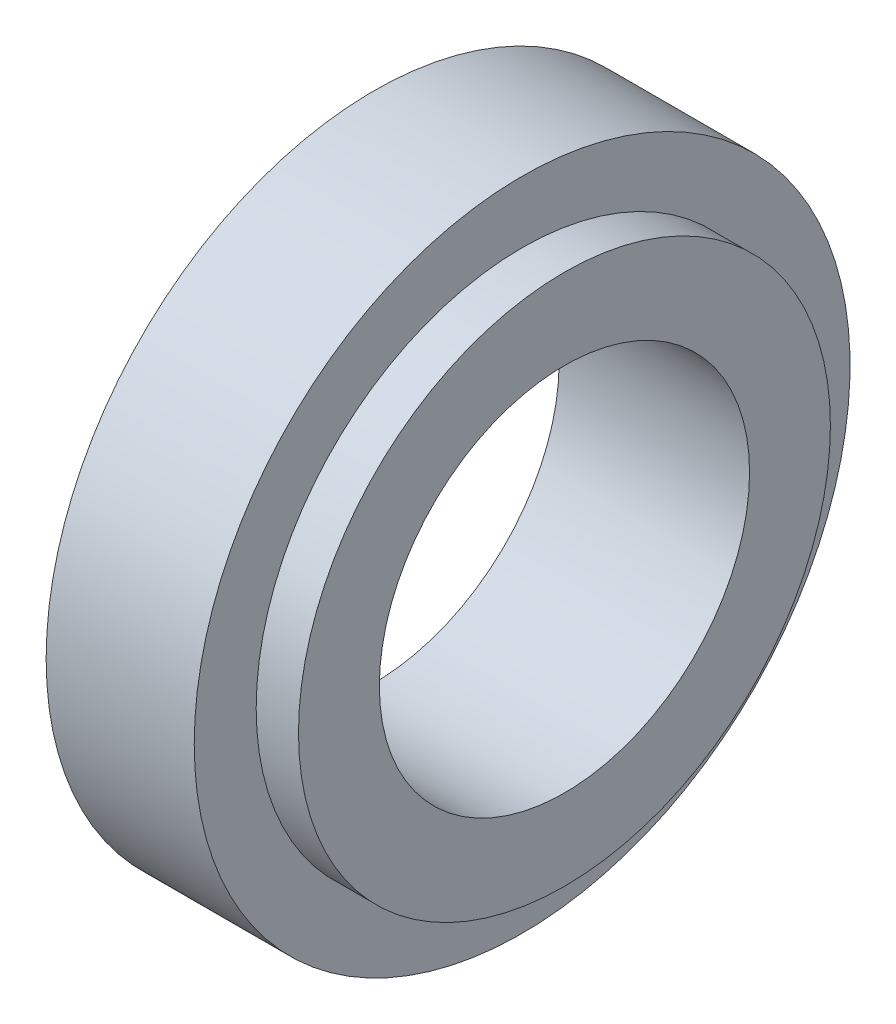
ISO-10303-21;
HEADER;
FILE_DESCRIPTION(('STEP AP214'),'2;1');
FILE_NAME('part.step','',(''),(''),'','','');
FILE_SCHEMA(('AUTOMOTIVE_DESIGN { 1 0 10303 214 1 1 1 1 }'));
ENDSEC;
DATA;
#1=APPLICATION_CONTEXT('core data for automotive mechanical design processes');
#2=APPLICATION_PROTOCOL_DEFINITION('international standard','automotive_design',2000,#1);
#3=PRODUCT_CONTEXT('',#1,'mechanical');
#4=PRODUCT('Part','Part','',(#3));
#5=PRODUCT_RELATED_PRODUCT_CATEGORY('part','',(#4));
#6=PRODUCT_DEFINITION_FORMATION('','',#4);
#7=PRODUCT_DEFINITION_CONTEXT('part definition',#1,'design');
#8=PRODUCT_DEFINITION('design','',#6,#7);
#9=PRODUCT_DEFINITION_SHAPE('','',#8);
#10=(LENGTH_UNIT() NAMED_UNIT(*) SI_UNIT(.MILLI.,.METRE.));
#11=(NAMED_UNIT(*) PLANE_ANGLE_UNIT() SI_UNIT($,.RADIAN.));
#12=(NAMED_UNIT(*) SI_UNIT($,.STERADIAN.) SOLID_ANGLE_UNIT());
#13=UNCERTAINTY_MEASURE_WITH_UNIT(LENGTH_MEASURE(1.E-05),#10,'distance_accuracy_value','');
#14=(GEOMETRIC_REPRESENTATION_CONTEXT(3) GLOBAL_UNCERTAINTY_ASSIGNED_CONTEXT((#13)) GLOBAL_UNIT_ASSIGNED_CONTEXT((#10,
#11,#12)) REPRESENTATION_CONTEXT('',''));
#15=CARTESIAN_POINT('',(0.,0.,0.));
#16=DIRECTION('',(0.,0.,1.));
#17=DIRECTION('',(1.,0.,0.));
#18=AXIS2_PLACEMENT_3D('',#15,#16,#17);
#19=CARTESIAN_POINT('',(0.,31.,0.));
#20=DIRECTION('',(1.,0.,0.));
#21=DIRECTION('',(0.,0.,-1.));
#22=AXIS2_PLACEMENT_3D('',#19,#20,#21);
#23=PLANE('',#22);
#24=CARTESIAN_POINT('',(0.,0.,0.));
#25=DIRECTION('',(-1.,0.,0.));
#26=DIRECTION('',(0.,0.,1.));
#27=AXIS2_PLACEMENT_3D('',#24,#25,#26);
#28=CIRCLE('',#27,17.5);
#29=CARTESIAN_POINT('',(0.,0.,17.5));
#30=VERTEX_POINT('',#29);
#31=EDGE_CURVE('E10',#30,#30,#28,.T.);
#32=ORIENTED_EDGE('',*,*,#31,.F.);
#33=EDGE_LOOP('',(#32));
#34=FACE_BOUND('',#33,.T.);
#35=CARTESIAN_POINT('',(0.,0.,0.));
#36=DIRECTION('',(-1.,0.,0.));
#37=DIRECTION('',(0.,0.,1.));
#38=AXIS2_PLACEMENT_3D('',#35,#36,#37);
#39=CIRCLE('',#38,31.);
#40=CARTESIAN_POINT('',(0.,0.,31.));
#41=VERTEX_POINT('',#40);
#42=EDGE_CURVE('E53',#41,#41,#39,.T.);
#43=ORIENTED_EDGE('',*,*,#42,.T.);
#44=EDGE_LOOP('',(#43));
#45=FACE_BOUND('',#44,.T.);
#46=ADVANCED_FACE('F31',(#34,#45),#23,.F.);
#47=CARTESIAN_POINT('',(0.,0.,0.));
#48=DIRECTION('',(-1.,0.,0.));
#49=DIRECTION('',(0.,0.,1.));
#50=AXIS2_PLACEMENT_3D('',#47,#48,#49);
#51=CYLINDRICAL_SURFACE('',#50,17.5);
#52=CARTESIAN_POINT('',(18.,0.,0.));
#53=DIRECTION('',(-1.,0.,0.));
#54=DIRECTION('',(0.,0.,1.));
#55=AXIS2_PLACEMENT_3D('',#52,#53,#54);
#56=CIRCLE('',#55,17.5);
#57=CARTESIAN_POINT('',(18.,0.,17.5));
#58=VERTEX_POINT('',#57);
#59=EDGE_CURVE('E37',#58,#58,#56,.T.);
#60=ORIENTED_EDGE('',*,*,#59,.F.);
#61=EDGE_LOOP('',(#60));
#62=FACE_BOUND('',#61,.T.);
#63=ORIENTED_EDGE('',*,*,#31,.T.);
#64=EDGE_LOOP('',(#63));
#65=FACE_BOUND('',#64,.T.);
#66=ADVANCED_FACE('F78',(#62,#65),#51,.F.);
#67=CARTESIAN_POINT('',(18.,17.5,0.));
#68=DIRECTION('',(-1.,0.,0.));
#69=DIRECTION('',(0.,0.,1.));
#70=AXIS2_PLACEMENT_3D('',#67,#68,#69);
#71=PLANE('',#70);
#72=CARTESIAN_POINT('',(18.,0.,0.));
#73=DIRECTION('',(-1.,0.,0.));
#74=DIRECTION('',(0.,0.,1.));
#75=AXIS2_PLACEMENT_3D('',#72,#73,#74);
#76=CIRCLE('',#75,25.1436781609195);
#77=CARTESIAN_POINT('',(18.,0.,25.1436781609195));
#78=VERTEX_POINT('',#77);
#79=EDGE_CURVE('E41',#78,#78,#76,.T.);
#80=ORIENTED_EDGE('',*,*,#79,.F.);
#81=EDGE_LOOP('',(#80));
#82=FACE_BOUND('',#81,.T.);
#83=ORIENTED_EDGE('',*,*,#59,.T.);
#84=EDGE_LOOP('',(#83));
#85=FACE_BOUND('',#84,.T.);
#86=ADVANCED_FACE('F73',(#82,#85),#71,.F.);
#87=CARTESIAN_POINT('',(0.,0.,0.));
#88=DIRECTION('',(-1.,0.,0.));
#89=DIRECTION('',(0.,0.,1.));
#90=AXIS2_PLACEMENT_3D('',#87,#88,#89);
#91=CYLINDRICAL_SURFACE('',#90,25.1436781609195);
#92=CARTESIAN_POINT('',(14.,0.,0.));
#93=DIRECTION('',(-1.,0.,0.));
#94=DIRECTION('',(0.,0.,1.));
#95=AXIS2_PLACEMENT_3D('',#92,#93,#94);
#96=CIRCLE('',#95,25.1436781609195);
#97=CARTESIAN_POINT('',(14.,0.,25.1436781609195));
#98=VERTEX_POINT('',#97);
#99=EDGE_CURVE('E45',#98,#98,#96,.T.);
#100=ORIENTED_EDGE('',*,*,#99,.F.);
#101=EDGE_LOOP('',(#100));
#102=FACE_BOUND('',#101,.T.);
#103=ORIENTED_EDGE('',*,*,#79,.T.);
#104=EDGE_LOOP('',(#103));
#105=FACE_BOUND('',#104,.T.);
#106=ADVANCED_FACE('F67',(#102,#105),#91,.T.);
#107=CARTESIAN_POINT('',(14.,25.1436781609195,0.));
#108=DIRECTION('',(-1.,0.,0.));
#109=DIRECTION('',(0.,0.,1.));
#110=AXIS2_PLACEMENT_3D('',#107,#108,#109);
#111=PLANE('',#110);
#112=CARTESIAN_POINT('',(14.,0.,0.));
#113=DIRECTION('',(-1.,0.,0.));
#114=DIRECTION('',(0.,0.,1.));
#115=AXIS2_PLACEMENT_3D('',#112,#113,#114);
#116=CIRCLE('',#115,31.);
#117=CARTESIAN_POINT('',(14.,0.,31.));
#118=VERTEX_POINT('',#117);
#119=EDGE_CURVE('E50',#118,#118,#116,.T.);
#120=ORIENTED_EDGE('',*,*,#119,.F.);
#121=EDGE_LOOP('',(#120));
#122=FACE_BOUND('',#121,.T.);
#123=ORIENTED_EDGE('',*,*,#99,.T.);
#124=EDGE_LOOP('',(#123));
#125=FACE_BOUND('',#124,.T.);
#126=ADVANCED_FACE('F61',(#122,#125),#111,.F.);
#127=CARTESIAN_POINT('',(0.,0.,0.));
#128=DIRECTION('',(-1.,0.,0.));
#129=DIRECTION('',(0.,0.,1.));
#130=AXIS2_PLACEMENT_3D('',#127,#128,#129);
#131=CYLINDRICAL_SURFACE('',#130,31.);
#132=ORIENTED_EDGE('',*,*,#42,.F.);
#133=EDGE_LOOP('',(#132));
#134=FACE_BOUND('',#133,.T.);
#135=ORIENTED_EDGE('',*,*,#119,.T.);
#136=EDGE_LOOP('',(#135));
#137=FACE_BOUND('',#136,.T.);
#138=ADVANCED_FACE('F58',(#134,#137),#131,.T.);
#139=CLOSED_SHELL('',(#46,#66,#86,#106,#126,#138));
#140=MANIFOLD_SOLID_BREP('B2',#139);
#141=ADVANCED_BREP_SHAPE_REPRESENTATION('',(#18,#140),#14);
#142=SHAPE_DEFINITION_REPRESENTATION(#9,#141);
ENDSEC;
END-ISO-10303-21;
